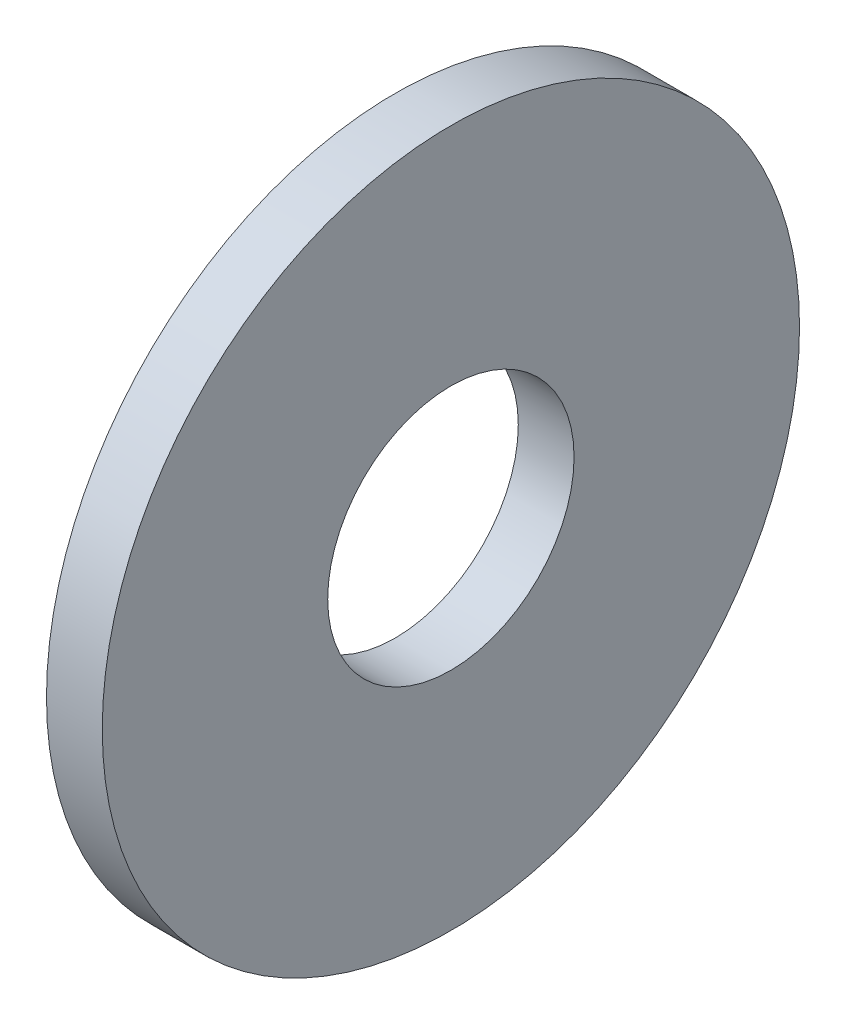
ISO-10303-21;
HEADER;
FILE_DESCRIPTION(('STEP AP214'),'2;1');
FILE_NAME('part.step','',(''),(''),'','','');
FILE_SCHEMA(('AUTOMOTIVE_DESIGN { 1 0 10303 214 1 1 1 1 }'));
ENDSEC;
DATA;
#1=APPLICATION_CONTEXT('core data for automotive mechanical design processes');
#2=APPLICATION_PROTOCOL_DEFINITION('international standard','automotive_design',2000,#1);
#3=PRODUCT_CONTEXT('',#1,'mechanical');
#4=PRODUCT('Part','Part','',(#3));
#5=PRODUCT_RELATED_PRODUCT_CATEGORY('part','',(#4));
#6=PRODUCT_DEFINITION_FORMATION('','',#4);
#7=PRODUCT_DEFINITION_CONTEXT('part definition',#1,'design');
#8=PRODUCT_DEFINITION('design','',#6,#7);
#9=PRODUCT_DEFINITION_SHAPE('','',#8);
#10=(LENGTH_UNIT() NAMED_UNIT(*) SI_UNIT(.MILLI.,.METRE.));
#11=(NAMED_UNIT(*) PLANE_ANGLE_UNIT() SI_UNIT($,.RADIAN.));
#12=(NAMED_UNIT(*) SI_UNIT($,.STERADIAN.) SOLID_ANGLE_UNIT());
#13=UNCERTAINTY_MEASURE_WITH_UNIT(LENGTH_MEASURE(1.E-05),#10,'distance_accuracy_value','');
#14=(GEOMETRIC_REPRESENTATION_CONTEXT(3) GLOBAL_UNCERTAINTY_ASSIGNED_CONTEXT((#13)) GLOBAL_UNIT_ASSIGNED_CONTEXT((#10,
#11,#12)) REPRESENTATION_CONTEXT('',''));
#15=CARTESIAN_POINT('',(0.,0.,0.));
#16=DIRECTION('',(0.,0.,1.));
#17=DIRECTION('',(1.,0.,0.));
#18=AXIS2_PLACEMENT_3D('',#15,#16,#17);
#19=CARTESIAN_POINT('',(-34.9249999999999,0.,0.));
#20=DIRECTION('',(-1.,0.,0.));
#21=DIRECTION('',(0.,0.,1.));
#22=AXIS2_PLACEMENT_3D('',#19,#20,#21);
#23=CYLINDRICAL_SURFACE('',#22,2.65);
#24=CARTESIAN_POINT('',(0.,0.,0.));
#25=DIRECTION('',(-1.,0.,0.));
#26=DIRECTION('',(0.,0.,1.));
#27=AXIS2_PLACEMENT_3D('',#24,#25,#26);
#28=CIRCLE('',#27,2.65);
#29=CARTESIAN_POINT('',(0.,0.,2.65));
#30=VERTEX_POINT('',#29);
#31=EDGE_CURVE('E10',#30,#30,#28,.T.);
#32=ORIENTED_EDGE('',*,*,#31,.F.);
#33=EDGE_LOOP('',(#32));
#34=FACE_BOUND('',#33,.T.);
#35=CARTESIAN_POINT('',(-1.2,0.,0.));
#36=DIRECTION('',(-1.,0.,0.));
#37=DIRECTION('',(0.,0.,1.));
#38=AXIS2_PLACEMENT_3D('',#35,#36,#37);
#39=CIRCLE('',#38,2.65);
#40=CARTESIAN_POINT('',(-1.2,0.,2.65));
#41=VERTEX_POINT('',#40);
#42=EDGE_CURVE('E46',#41,#41,#39,.T.);
#43=ORIENTED_EDGE('',*,*,#42,.T.);
#44=EDGE_LOOP('',(#43));
#45=FACE_BOUND('',#44,.T.);
#46=ADVANCED_FACE('F32',(#34,#45),#23,.F.);
#47=CARTESIAN_POINT('',(0.,2.65,0.));
#48=DIRECTION('',(-1.,0.,0.));
#49=DIRECTION('',(0.,0.,1.));
#50=AXIS2_PLACEMENT_3D('',#47,#48,#49);
#51=PLANE('',#50);
#52=CARTESIAN_POINT('',(0.,0.,0.));
#53=DIRECTION('',(-1.,0.,0.));
#54=DIRECTION('',(0.,0.,1.));
#55=AXIS2_PLACEMENT_3D('',#52,#53,#54);
#56=CIRCLE('',#55,7.5);
#57=CARTESIAN_POINT('',(0.,0.,7.5));
#58=VERTEX_POINT('',#57);
#59=EDGE_CURVE('E38',#58,#58,#56,.T.);
#60=ORIENTED_EDGE('',*,*,#59,.F.);
#61=EDGE_LOOP('',(#60));
#62=FACE_BOUND('',#61,.T.);
#63=ORIENTED_EDGE('',*,*,#31,.T.);
#64=EDGE_LOOP('',(#63));
#65=FACE_BOUND('',#64,.T.);
#66=ADVANCED_FACE('F61',(#62,#65),#51,.F.);
#67=CARTESIAN_POINT('',(-34.9249999999999,0.,0.));
#68=DIRECTION('',(-1.,0.,0.));
#69=DIRECTION('',(0.,0.,1.));
#70=AXIS2_PLACEMENT_3D('',#67,#68,#69);
#71=CYLINDRICAL_SURFACE('',#70,7.5);
#72=CARTESIAN_POINT('',(-1.2,0.,0.));
#73=DIRECTION('',(-1.,0.,0.));
#74=DIRECTION('',(0.,0.,1.));
#75=AXIS2_PLACEMENT_3D('',#72,#73,#74);
#76=CIRCLE('',#75,7.5);
#77=CARTESIAN_POINT('',(-1.2,0.,7.5));
#78=VERTEX_POINT('',#77);
#79=EDGE_CURVE('E42',#78,#78,#76,.T.);
#80=ORIENTED_EDGE('',*,*,#79,.F.);
#81=EDGE_LOOP('',(#80));
#82=FACE_BOUND('',#81,.T.);
#83=ORIENTED_EDGE('',*,*,#59,.T.);
#84=EDGE_LOOP('',(#83));
#85=FACE_BOUND('',#84,.T.);
#86=ADVANCED_FACE('F56',(#82,#85),#71,.T.);
#87=CARTESIAN_POINT('',(-1.2,7.5,0.));
#88=DIRECTION('',(1.,0.,0.));
#89=DIRECTION('',(0.,0.,-1.));
#90=AXIS2_PLACEMENT_3D('',#87,#88,#89);
#91=PLANE('',#90);
#92=ORIENTED_EDGE('',*,*,#42,.F.);
#93=EDGE_LOOP('',(#92));
#94=FACE_BOUND('',#93,.T.);
#95=ORIENTED_EDGE('',*,*,#79,.T.);
#96=EDGE_LOOP('',(#95));
#97=FACE_BOUND('',#96,.T.);
#98=ADVANCED_FACE('F53',(#94,#97),#91,.F.);
#99=CLOSED_SHELL('',(#46,#66,#86,#98));
#100=MANIFOLD_SOLID_BREP('B2',#99);
#101=ADVANCED_BREP_SHAPE_REPRESENTATION('',(#18,#100),#14);
#102=SHAPE_DEFINITION_REPRESENTATION(#9,#101);
ENDSEC;
END-ISO-10303-21;
